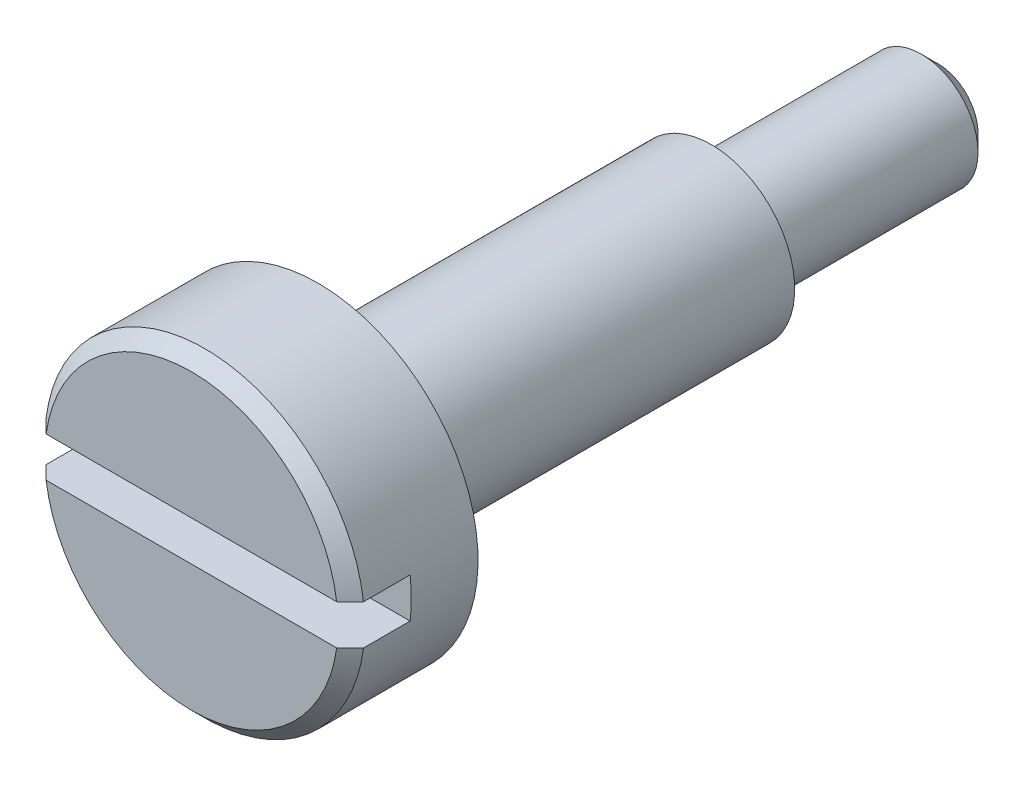
ISO-10303-21;
HEADER;
FILE_DESCRIPTION(('STEP AP214'),'2;1');
FILE_NAME('part.step','',(''),(''),'','','');
FILE_SCHEMA(('AUTOMOTIVE_DESIGN { 1 0 10303 214 1 1 1 1 }'));
ENDSEC;
DATA;
#1=APPLICATION_CONTEXT('core data for automotive mechanical design processes');
#2=APPLICATION_PROTOCOL_DEFINITION('international standard','automotive_design',2000,#1);
#3=PRODUCT_CONTEXT('',#1,'mechanical');
#4=PRODUCT('Part','Part','',(#3));
#5=PRODUCT_RELATED_PRODUCT_CATEGORY('part','',(#4));
#6=PRODUCT_DEFINITION_FORMATION('','',#4);
#7=PRODUCT_DEFINITION_CONTEXT('part definition',#1,'design');
#8=PRODUCT_DEFINITION('design','',#6,#7);
#9=PRODUCT_DEFINITION_SHAPE('','',#8);
#10=(LENGTH_UNIT() NAMED_UNIT(*) SI_UNIT(.MILLI.,.METRE.));
#11=(NAMED_UNIT(*) PLANE_ANGLE_UNIT() SI_UNIT($,.RADIAN.));
#12=(NAMED_UNIT(*) SI_UNIT($,.STERADIAN.) SOLID_ANGLE_UNIT());
#13=UNCERTAINTY_MEASURE_WITH_UNIT(LENGTH_MEASURE(1.E-05),#10,'distance_accuracy_value','');
#14=(GEOMETRIC_REPRESENTATION_CONTEXT(3) GLOBAL_UNCERTAINTY_ASSIGNED_CONTEXT((#13)) GLOBAL_UNIT_ASSIGNED_CONTEXT((#10,
#11,#12)) REPRESENTATION_CONTEXT('',''));
#15=CARTESIAN_POINT('',(0.,0.,0.));
#16=DIRECTION('',(0.,0.,1.));
#17=DIRECTION('',(1.,0.,0.));
#18=AXIS2_PLACEMENT_3D('',#15,#16,#17);
#19=CARTESIAN_POINT('',(0.,0.,-11.2));
#20=DIRECTION('',(0.,0.,1.));
#21=DIRECTION('',(1.,0.,0.));
#22=AXIS2_PLACEMENT_3D('',#19,#20,#21);
#23=CYLINDRICAL_SURFACE('',#22,2.4);
#24=CARTESIAN_POINT('',(0.,0.,-1.9));
#25=DIRECTION('',(0.,0.,-1.));
#26=DIRECTION('',(-1.,0.,0.));
#27=AXIS2_PLACEMENT_3D('',#24,#25,#26);
#28=CIRCLE('',#27,2.4);
#29=CARTESIAN_POINT('',(-2.4,0.,-1.9));
#30=VERTEX_POINT('',#29);
#31=EDGE_CURVE('E146',#30,#30,#28,.F.);
#32=ORIENTED_EDGE('',*,*,#31,.T.);
#33=EDGE_LOOP('',(#32));
#34=FACE_BOUND('',#33,.T.);
#35=DIRECTION('',(0.,0.,1.));
#36=VECTOR('',#35,1.);
#37=CARTESIAN_POINT('',(2.38117617995813,-0.3,-11.2));
#38=LINE('',#37,#36);
#39=CARTESIAN_POINT('',(2.38117617995813,-0.3,-0.200000000000001));
#40=VERTEX_POINT('',#39);
#41=CARTESIAN_POINT('',(2.38117617995813,-0.3,-0.9));
#42=VERTEX_POINT('',#41);
#43=EDGE_CURVE('E133',#40,#42,#38,.F.);
#44=ORIENTED_EDGE('',*,*,#43,.F.);
#45=CARTESIAN_POINT('',(0.,0.,-0.200000000000001));
#46=DIRECTION('',(0.,0.,1.));
#47=DIRECTION('',(1.,0.,0.));
#48=AXIS2_PLACEMENT_3D('',#45,#46,#47);
#49=CIRCLE('',#48,2.4);
#50=CARTESIAN_POINT('',(-2.38117617995813,-0.3,-0.200000000000001));
#51=VERTEX_POINT('',#50);
#52=EDGE_CURVE('E136',#40,#51,#49,.F.);
#53=ORIENTED_EDGE('',*,*,#52,.T.);
#54=DIRECTION('',(0.,0.,1.));
#55=VECTOR('',#54,1.);
#56=CARTESIAN_POINT('',(-2.38117617995813,-0.3,-11.2));
#57=LINE('',#56,#55);
#58=CARTESIAN_POINT('',(-2.38117617995813,-0.3,-0.9));
#59=VERTEX_POINT('',#58);
#60=EDGE_CURVE('E130',#59,#51,#57,.T.);
#61=ORIENTED_EDGE('',*,*,#60,.F.);
#62=CARTESIAN_POINT('',(0.,0.,-0.9));
#63=DIRECTION('',(0.,0.,-1.));
#64=DIRECTION('',(-1.,0.,0.));
#65=AXIS2_PLACEMENT_3D('',#62,#63,#64);
#66=CIRCLE('',#65,2.4);
#67=CARTESIAN_POINT('',(-2.38117617995813,0.3,-0.9));
#68=VERTEX_POINT('',#67);
#69=EDGE_CURVE('E112',#68,#59,#66,.F.);
#70=ORIENTED_EDGE('',*,*,#69,.F.);
#71=DIRECTION('',(0.,0.,1.));
#72=VECTOR('',#71,1.);
#73=CARTESIAN_POINT('',(-2.38117617995813,0.3,-11.2));
#74=LINE('',#73,#72);
#75=CARTESIAN_POINT('',(-2.38117617995813,0.3,-0.200000000000001));
#76=VERTEX_POINT('',#75);
#77=EDGE_CURVE('E138',#68,#76,#74,.T.);
#78=ORIENTED_EDGE('',*,*,#77,.T.);
#79=CARTESIAN_POINT('',(0.,0.,-0.200000000000001));
#80=DIRECTION('',(0.,0.,1.));
#81=DIRECTION('',(1.,0.,0.));
#82=AXIS2_PLACEMENT_3D('',#79,#80,#81);
#83=CIRCLE('',#82,2.4);
#84=CARTESIAN_POINT('',(2.38117617995813,0.3,-0.200000000000001));
#85=VERTEX_POINT('',#84);
#86=EDGE_CURVE('E355',#76,#85,#83,.F.);
#87=ORIENTED_EDGE('',*,*,#86,.T.);
#88=DIRECTION('',(0.,0.,1.));
#89=VECTOR('',#88,1.);
#90=CARTESIAN_POINT('',(2.38117617995813,0.3,-11.2));
#91=LINE('',#90,#89);
#92=CARTESIAN_POINT('',(2.38117617995813,0.3,-0.9));
#93=VERTEX_POINT('',#92);
#94=EDGE_CURVE('E143',#85,#93,#91,.F.);
#95=ORIENTED_EDGE('',*,*,#94,.T.);
#96=EDGE_CURVE('E123',#42,#93,#66,.F.);
#97=ORIENTED_EDGE('',*,*,#96,.F.);
#98=EDGE_LOOP('',(#44,#53,#61,#70,#78,#87,#95,#97));
#99=FACE_BOUND('',#98,.T.);
#100=ADVANCED_FACE('F55',(#34,#99),#23,.T.);
#101=CARTESIAN_POINT('',(0.,0.,0.));
#102=DIRECTION('',(0.,0.,1.));
#103=DIRECTION('',(1.,0.,0.));
#104=AXIS2_PLACEMENT_3D('',#101,#102,#103);
#105=PLANE('',#104);
#106=DIRECTION('',(1.,0.,0.));
#107=VECTOR('',#106,1.);
#108=CARTESIAN_POINT('',(0.,0.3,0.));
#109=LINE('',#108,#107);
#110=CARTESIAN_POINT('',(-2.17944947177034,0.3,0.));
#111=VERTEX_POINT('',#110);
#112=CARTESIAN_POINT('',(2.17944947177034,0.3,0.));
#113=VERTEX_POINT('',#112);
#114=EDGE_CURVE('E124',#111,#113,#109,.T.);
#115=ORIENTED_EDGE('',*,*,#114,.T.);
#116=CARTESIAN_POINT('',(0.,0.,0.));
#117=DIRECTION('',(0.,0.,1.));
#118=DIRECTION('',(1.,0.,0.));
#119=AXIS2_PLACEMENT_3D('',#116,#117,#118);
#120=CIRCLE('',#119,2.2);
#121=EDGE_CURVE('E356',#113,#111,#120,.T.);
#122=ORIENTED_EDGE('',*,*,#121,.T.);
#123=EDGE_LOOP('',(#115,#122));
#124=FACE_BOUND('',#123,.T.);
#125=ADVANCED_FACE('F218',(#124),#105,.T.);
#126=CARTESIAN_POINT('',(0.,0.,-1.9));
#127=DIRECTION('',(0.,0.,-1.));
#128=DIRECTION('',(-1.,0.,0.));
#129=AXIS2_PLACEMENT_3D('',#126,#127,#128);
#130=CYLINDRICAL_SURFACE('',#129,1.25);
#131=CARTESIAN_POINT('',(0.,0.,-2.));
#132=DIRECTION('',(0.,0.,-1.));
#133=DIRECTION('',(-1.,0.,0.));
#134=AXIS2_PLACEMENT_3D('',#131,#132,#133);
#135=CIRCLE('',#134,1.25);
#136=CARTESIAN_POINT('',(-1.25,0.,-2.));
#137=VERTEX_POINT('',#136);
#138=EDGE_CURVE('E160',#137,#137,#135,.T.);
#139=ORIENTED_EDGE('',*,*,#138,.T.);
#140=EDGE_LOOP('',(#139));
#141=FACE_BOUND('',#140,.T.);
#142=CARTESIAN_POINT('',(0.,0.,-7.8));
#143=DIRECTION('',(0.,0.,-1.));
#144=DIRECTION('',(-1.,0.,0.));
#145=AXIS2_PLACEMENT_3D('',#142,#143,#144);
#146=CIRCLE('',#145,1.25);
#147=CARTESIAN_POINT('',(-1.25,0.,-7.8));
#148=VERTEX_POINT('',#147);
#149=EDGE_CURVE('E145',#148,#148,#146,.F.);
#150=ORIENTED_EDGE('',*,*,#149,.T.);
#151=EDGE_LOOP('',(#150));
#152=FACE_BOUND('',#151,.T.);
#153=ADVANCED_FACE('F224',(#141,#152),#130,.T.);
#154=DIRECTION('',(1.,0.,0.));
#155=VECTOR('',#154,1.);
#156=CARTESIAN_POINT('',(0.,-0.3,0.));
#157=LINE('',#156,#155);
#158=CARTESIAN_POINT('',(-2.17944947177034,-0.3,0.));
#159=VERTEX_POINT('',#158);
#160=CARTESIAN_POINT('',(2.17944947177034,-0.3,0.));
#161=VERTEX_POINT('',#160);
#162=EDGE_CURVE('E149',#159,#161,#157,.T.);
#163=ORIENTED_EDGE('',*,*,#162,.F.);
#164=CARTESIAN_POINT('',(0.,0.,0.));
#165=DIRECTION('',(0.,0.,1.));
#166=DIRECTION('',(1.,0.,0.));
#167=AXIS2_PLACEMENT_3D('',#164,#165,#166);
#168=CIRCLE('',#167,2.2);
#169=EDGE_CURVE('E166',#159,#161,#168,.T.);
#170=ORIENTED_EDGE('',*,*,#169,.T.);
#171=EDGE_LOOP('',(#163,#170));
#172=FACE_BOUND('',#171,.T.);
#173=ADVANCED_FACE('F227',(#172),#105,.T.);
#174=CARTESIAN_POINT('',(0.,0.,-1.9));
#175=DIRECTION('',(0.,0.,-1.));
#176=DIRECTION('',(-1.,0.,0.));
#177=AXIS2_PLACEMENT_3D('',#174,#175,#176);
#178=PLANE('',#177);
#179=CARTESIAN_POINT('',(0.,0.,-1.9));
#180=DIRECTION('',(0.,0.,-1.));
#181=DIRECTION('',(-1.,0.,0.));
#182=AXIS2_PLACEMENT_3D('',#179,#180,#181);
#183=CIRCLE('',#182,1.35);
#184=CARTESIAN_POINT('',(-1.35,0.,-1.9));
#185=VERTEX_POINT('',#184);
#186=EDGE_CURVE('E163',#185,#185,#183,.F.);
#187=ORIENTED_EDGE('',*,*,#186,.T.);
#188=EDGE_LOOP('',(#187));
#189=FACE_BOUND('',#188,.T.);
#190=ORIENTED_EDGE('',*,*,#31,.F.);
#191=EDGE_LOOP('',(#190));
#192=FACE_BOUND('',#191,.T.);
#193=ADVANCED_FACE('F248',(#189,#192),#178,.T.);
#194=CARTESIAN_POINT('',(0.,0.,-7.8));
#195=DIRECTION('',(0.,0.,-1.));
#196=DIRECTION('',(-1.,0.,0.));
#197=AXIS2_PLACEMENT_3D('',#194,#195,#196);
#198=PLANE('',#197);
#199=CARTESIAN_POINT('',(0.,0.,-7.8));
#200=DIRECTION('',(0.,0.,-1.));
#201=DIRECTION('',(-1.,0.,0.));
#202=AXIS2_PLACEMENT_3D('',#199,#200,#201);
#203=CIRCLE('',#202,0.95);
#204=CARTESIAN_POINT('',(-0.95,0.,-7.8));
#205=VERTEX_POINT('',#204);
#206=EDGE_CURVE('E157',#205,#205,#203,.F.);
#207=ORIENTED_EDGE('',*,*,#206,.T.);
#208=EDGE_LOOP('',(#207));
#209=FACE_BOUND('',#208,.T.);
#210=ORIENTED_EDGE('',*,*,#149,.F.);
#211=EDGE_LOOP('',(#210));
#212=FACE_BOUND('',#211,.T.);
#213=ADVANCED_FACE('F246',(#209,#212),#198,.T.);
#214=CARTESIAN_POINT('',(0.,0.,-7.8));
#215=DIRECTION('',(0.,0.,-1.));
#216=DIRECTION('',(-1.,0.,0.));
#217=AXIS2_PLACEMENT_3D('',#214,#215,#216);
#218=CYLINDRICAL_SURFACE('',#217,0.85);
#219=CARTESIAN_POINT('',(0.,0.,-10.95));
#220=DIRECTION('',(0.,0.,1.));
#221=DIRECTION('',(1.,0.,0.));
#222=AXIS2_PLACEMENT_3D('',#219,#220,#221);
#223=CIRCLE('',#222,0.85);
#224=CARTESIAN_POINT('',(0.85,0.,-10.95));
#225=VERTEX_POINT('',#224);
#226=EDGE_CURVE('E14',#225,#225,#223,.T.);
#227=ORIENTED_EDGE('',*,*,#226,.T.);
#228=EDGE_LOOP('',(#227));
#229=FACE_BOUND('',#228,.T.);
#230=CARTESIAN_POINT('',(0.,0.,-7.9));
#231=DIRECTION('',(0.,0.,-1.));
#232=DIRECTION('',(-1.,0.,0.));
#233=AXIS2_PLACEMENT_3D('',#230,#231,#232);
#234=CIRCLE('',#233,0.85);
#235=CARTESIAN_POINT('',(-0.85,0.,-7.9));
#236=VERTEX_POINT('',#235);
#237=EDGE_CURVE('E154',#236,#236,#234,.T.);
#238=ORIENTED_EDGE('',*,*,#237,.T.);
#239=EDGE_LOOP('',(#238));
#240=FACE_BOUND('',#239,.T.);
#241=ADVANCED_FACE('F194',(#229,#240),#218,.T.);
#242=CARTESIAN_POINT('',(0.,0.,-11.2));
#243=DIRECTION('',(0.,0.,1.));
#244=DIRECTION('',(1.,0.,0.));
#245=AXIS2_PLACEMENT_3D('',#242,#243,#244);
#246=PLANE('',#245);
#247=CARTESIAN_POINT('',(0.,0.,-11.2));
#248=DIRECTION('',(0.,0.,1.));
#249=DIRECTION('',(1.,0.,0.));
#250=AXIS2_PLACEMENT_3D('',#247,#248,#249);
#251=CIRCLE('',#250,0.600000000000002);
#252=CARTESIAN_POINT('',(0.600000000000002,0.,-11.2));
#253=VERTEX_POINT('',#252);
#254=EDGE_CURVE('E63',#253,#253,#251,.F.);
#255=ORIENTED_EDGE('',*,*,#254,.T.);
#256=EDGE_LOOP('',(#255));
#257=FACE_BOUND('',#256,.T.);
#258=ADVANCED_FACE('F193',(#257),#246,.F.);
#259=CARTESIAN_POINT('',(-2.5,0.3,-0.9));
#260=DIRECTION('',(0.,-1.,0.));
#261=DIRECTION('',(0.,0.,-1.));
#262=AXIS2_PLACEMENT_3D('',#259,#260,#261);
#263=PLANE('',#262);
#264=ORIENTED_EDGE('',*,*,#114,.F.);
#265=CARTESIAN_POINT('',(-2.17944947177034,0.3,0.));
#266=CARTESIAN_POINT('',(-2.2130831557814,0.3,-0.0333206589685429));
#267=CARTESIAN_POINT('',(-2.24671055682854,0.3,-0.0666476551452363));
#268=CARTESIAN_POINT('',(-2.3139527928911,0.3,-0.133314321811942));
#269=CARTESIAN_POINT('',(-2.34756762790656,0.3,-0.166653992301916));
#270=CARTESIAN_POINT('',(-2.38117617995813,0.3,-0.2));
#271=B_SPLINE_CURVE_WITH_KNOTS('',3,(#265,#266,#267,#268,#269,#270),.UNSPECIFIED.,.F.,.F.,(4,2,
4),(0.,0.142033154503159,0.284066308567514),.UNSPECIFIED.);
#272=EDGE_CURVE('E78',#111,#76,#271,.T.);
#273=ORIENTED_EDGE('',*,*,#272,.T.);
#274=ORIENTED_EDGE('',*,*,#77,.F.);
#275=DIRECTION('',(1.,0.,0.));
#276=VECTOR('',#275,1.);
#277=CARTESIAN_POINT('',(-2.5,0.3,-0.9));
#278=LINE('',#277,#276);
#279=EDGE_CURVE('E119',#68,#93,#278,.T.);
#280=ORIENTED_EDGE('',*,*,#279,.T.);
#281=ORIENTED_EDGE('',*,*,#94,.F.);
#282=CARTESIAN_POINT('',(2.38117617995813,0.3,-0.200000000000001));
#283=CARTESIAN_POINT('',(2.34756762790656,0.3,-0.166653992301916));
#284=CARTESIAN_POINT('',(2.3139527928911,0.3,-0.133314321811942));
#285=CARTESIAN_POINT('',(2.24671055682854,0.3,-0.0666476551452363));
#286=CARTESIAN_POINT('',(2.2130831557814,0.3,-0.033320658968543));
#287=CARTESIAN_POINT('',(2.17944947177034,0.3,0.));
#288=B_SPLINE_CURVE_WITH_KNOTS('',3,(#282,#283,#284,#285,#286,#287),.UNSPECIFIED.,.F.,.F.,(4,2,
4),(0.,0.142033154064355,0.284066308567514),.UNSPECIFIED.);
#289=EDGE_CURVE('E70',#85,#113,#288,.T.);
#290=ORIENTED_EDGE('',*,*,#289,.T.);
#291=EDGE_LOOP('',(#264,#273,#274,#280,#281,#290));
#292=FACE_BOUND('',#291,.T.);
#293=ADVANCED_FACE('F188',(#292),#263,.T.);
#294=CARTESIAN_POINT('',(-2.5,-0.3,-0.9));
#295=DIRECTION('',(0.,-1.,0.));
#296=DIRECTION('',(0.,0.,-1.));
#297=AXIS2_PLACEMENT_3D('',#294,#295,#296);
#298=PLANE('',#297);
#299=ORIENTED_EDGE('',*,*,#162,.T.);
#300=CARTESIAN_POINT('',(2.17944947177034,-0.3,0.));
#301=CARTESIAN_POINT('',(2.2130831557814,-0.3,-0.0333206589685429));
#302=CARTESIAN_POINT('',(2.24671055682854,-0.3,-0.0666476551452363));
#303=CARTESIAN_POINT('',(2.3139527928911,-0.3,-0.133314321811942));
#304=CARTESIAN_POINT('',(2.34756762790656,-0.3,-0.166653992301916));
#305=CARTESIAN_POINT('',(2.38117617995813,-0.3,-0.2));
#306=B_SPLINE_CURVE_WITH_KNOTS('',3,(#300,#301,#302,#303,#304,#305),.UNSPECIFIED.,.F.,.F.,(4,2,
4),(0.,0.142033154503159,0.284066308567514),.UNSPECIFIED.);
#307=EDGE_CURVE('E176',#161,#40,#306,.T.);
#308=ORIENTED_EDGE('',*,*,#307,.T.);
#309=ORIENTED_EDGE('',*,*,#43,.T.);
#310=DIRECTION('',(1.,0.,0.));
#311=VECTOR('',#310,1.);
#312=CARTESIAN_POINT('',(-2.5,-0.3,-0.9));
#313=LINE('',#312,#311);
#314=EDGE_CURVE('E116',#59,#42,#313,.T.);
#315=ORIENTED_EDGE('',*,*,#314,.F.);
#316=ORIENTED_EDGE('',*,*,#60,.T.);
#317=CARTESIAN_POINT('',(-2.38117617995813,-0.3,-0.200000000000001));
#318=CARTESIAN_POINT('',(-2.34756762790656,-0.3,-0.166653992301916));
#319=CARTESIAN_POINT('',(-2.3139527928911,-0.3,-0.133314321811942));
#320=CARTESIAN_POINT('',(-2.24671055682854,-0.3,-0.0666476551452363));
#321=CARTESIAN_POINT('',(-2.2130831557814,-0.3,-0.033320658968543));
#322=CARTESIAN_POINT('',(-2.17944947177034,-0.3,0.));
#323=B_SPLINE_CURVE_WITH_KNOTS('',3,(#317,#318,#319,#320,#321,#322),.UNSPECIFIED.,.F.,.F.,(4,2,
4),(0.,0.142033154064355,0.284066308567514),.UNSPECIFIED.);
#324=EDGE_CURVE('E169',#51,#159,#323,.T.);
#325=ORIENTED_EDGE('',*,*,#324,.T.);
#326=EDGE_LOOP('',(#299,#308,#309,#315,#316,#325));
#327=FACE_BOUND('',#326,.T.);
#328=ADVANCED_FACE('F129',(#327),#298,.F.);
#329=CARTESIAN_POINT('',(0.,0.,-0.9));
#330=DIRECTION('',(0.,0.,-1.));
#331=DIRECTION('',(-1.,0.,0.));
#332=AXIS2_PLACEMENT_3D('',#329,#330,#331);
#333=PLANE('',#332);
#334=ORIENTED_EDGE('',*,*,#96,.T.);
#335=ORIENTED_EDGE('',*,*,#279,.F.);
#336=ORIENTED_EDGE('',*,*,#69,.T.);
#337=ORIENTED_EDGE('',*,*,#314,.T.);
#338=EDGE_LOOP('',(#334,#335,#336,#337));
#339=FACE_BOUND('',#338,.T.);
#340=ADVANCED_FACE('F115',(#339),#333,.F.);
#341=CARTESIAN_POINT('',(0.,0.,-7.9));
#342=DIRECTION('',(0.,0.,-1.));
#343=DIRECTION('',(-1.,0.,0.));
#344=AXIS2_PLACEMENT_3D('',#341,#342,#343);
#345=TOROIDAL_SURFACE('',#344,0.95,0.1);
#346=ORIENTED_EDGE('',*,*,#206,.F.);
#347=EDGE_LOOP('',(#346));
#348=FACE_BOUND('',#347,.T.);
#349=ORIENTED_EDGE('',*,*,#237,.F.);
#350=EDGE_LOOP('',(#349));
#351=FACE_BOUND('',#350,.T.);
#352=ADVANCED_FACE('F230',(#348,#351),#345,.F.);
#353=CARTESIAN_POINT('',(0.,0.,-2.));
#354=DIRECTION('',(0.,0.,-1.));
#355=DIRECTION('',(-1.,0.,0.));
#356=AXIS2_PLACEMENT_3D('',#353,#354,#355);
#357=TOROIDAL_SURFACE('',#356,1.35,0.1);
#358=ORIENTED_EDGE('',*,*,#186,.F.);
#359=EDGE_LOOP('',(#358));
#360=FACE_BOUND('',#359,.T.);
#361=ORIENTED_EDGE('',*,*,#138,.F.);
#362=EDGE_LOOP('',(#361));
#363=FACE_BOUND('',#362,.T.);
#364=ADVANCED_FACE('F215',(#360,#363),#357,.F.);
#365=CARTESIAN_POINT('',(0.,0.,0.));
#366=DIRECTION('',(0.,0.,-1.));
#367=DIRECTION('',(-1.,0.,0.));
#368=AXIS2_PLACEMENT_3D('',#365,#366,#367);
#369=CONICAL_SURFACE('',#368,2.2,0.785398163397445);
#370=ORIENTED_EDGE('',*,*,#324,.F.);
#371=ORIENTED_EDGE('',*,*,#52,.F.);
#372=ORIENTED_EDGE('',*,*,#307,.F.);
#373=ORIENTED_EDGE('',*,*,#169,.F.);
#374=EDGE_LOOP('',(#370,#371,#372,#373));
#375=FACE_BOUND('',#374,.T.);
#376=ADVANCED_FACE('F181',(#375),#369,.T.);
#377=CARTESIAN_POINT('',(0.,0.,0.));
#378=DIRECTION('',(0.,0.,-1.));
#379=DIRECTION('',(-1.,0.,0.));
#380=AXIS2_PLACEMENT_3D('',#377,#378,#379);
#381=CONICAL_SURFACE('',#380,2.2,0.785398163397445);
#382=ORIENTED_EDGE('',*,*,#289,.F.);
#383=ORIENTED_EDGE('',*,*,#86,.F.);
#384=ORIENTED_EDGE('',*,*,#272,.F.);
#385=ORIENTED_EDGE('',*,*,#121,.F.);
#386=EDGE_LOOP('',(#382,#383,#384,#385));
#387=FACE_BOUND('',#386,.T.);
#388=ADVANCED_FACE('F206',(#387),#381,.T.);
#389=CARTESIAN_POINT('',(0.,0.,-11.2));
#390=DIRECTION('',(0.,0.,1.));
#391=DIRECTION('',(1.,0.,0.));
#392=AXIS2_PLACEMENT_3D('',#389,#390,#391);
#393=CONICAL_SURFACE('',#392,0.600000000000002,0.785398163397445);
#394=ORIENTED_EDGE('',*,*,#226,.F.);
#395=EDGE_LOOP('',(#394));
#396=FACE_BOUND('',#395,.T.);
#397=ORIENTED_EDGE('',*,*,#254,.F.);
#398=EDGE_LOOP('',(#397));
#399=FACE_BOUND('',#398,.T.);
#400=ADVANCED_FACE('F57',(#396,#399),#393,.T.);
#401=CLOSED_SHELL('',(#100,#125,#153,#173,#193,#213,#241,#258,#293,#328,#340,#352,#364,#376,
#388,#400));
#402=MANIFOLD_SOLID_BREP('B2',#401);
#403=ADVANCED_BREP_SHAPE_REPRESENTATION('',(#18,#402),#14);
#404=SHAPE_DEFINITION_REPRESENTATION(#9,#403);
ENDSEC;
END-ISO-10303-21;
